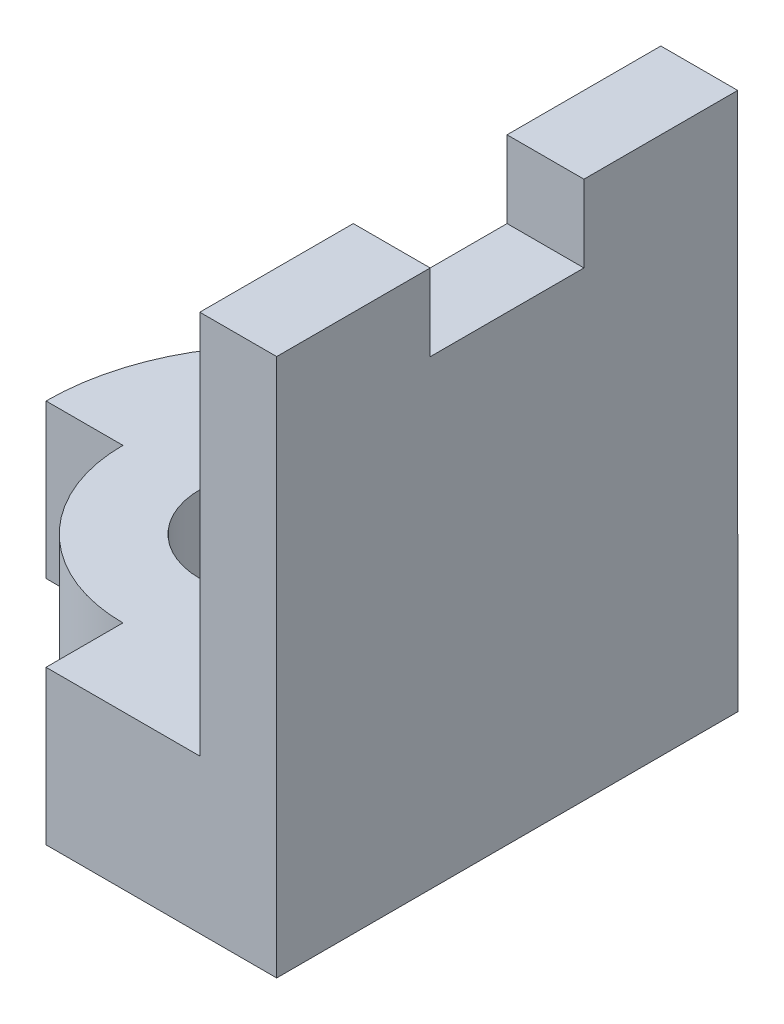
ISO-10303-21;
HEADER;
FILE_DESCRIPTION(('STEP AP214'),'2;1');
FILE_NAME('part.step','',(''),(''),'','','');
FILE_SCHEMA(('AUTOMOTIVE_DESIGN { 1 0 10303 214 1 1 1 1 }'));
ENDSEC;
DATA;
#1=APPLICATION_CONTEXT('core data for automotive mechanical design processes');
#2=APPLICATION_PROTOCOL_DEFINITION('international standard','automotive_design',2000,#1);
#3=PRODUCT_CONTEXT('',#1,'mechanical');
#4=PRODUCT('Part','Part','',(#3));
#5=PRODUCT_RELATED_PRODUCT_CATEGORY('part','',(#4));
#6=PRODUCT_DEFINITION_FORMATION('','',#4);
#7=PRODUCT_DEFINITION_CONTEXT('part definition',#1,'design');
#8=PRODUCT_DEFINITION('design','',#6,#7);
#9=PRODUCT_DEFINITION_SHAPE('','',#8);
#10=(LENGTH_UNIT() NAMED_UNIT(*) SI_UNIT(.MILLI.,.METRE.));
#11=(NAMED_UNIT(*) PLANE_ANGLE_UNIT() SI_UNIT($,.RADIAN.));
#12=(NAMED_UNIT(*) SI_UNIT($,.STERADIAN.) SOLID_ANGLE_UNIT());
#13=UNCERTAINTY_MEASURE_WITH_UNIT(LENGTH_MEASURE(1.E-05),#10,'distance_accuracy_value','');
#14=(GEOMETRIC_REPRESENTATION_CONTEXT(3) GLOBAL_UNCERTAINTY_ASSIGNED_CONTEXT((#13)) GLOBAL_UNIT_ASSIGNED_CONTEXT((#10,
#11,#12)) REPRESENTATION_CONTEXT('',''));
#15=CARTESIAN_POINT('',(0.,0.,0.));
#16=DIRECTION('',(0.,0.,1.));
#17=DIRECTION('',(1.,0.,0.));
#18=AXIS2_PLACEMENT_3D('',#15,#16,#17);
#19=CARTESIAN_POINT('',(0.,2.,0.));
#20=DIRECTION('',(0.,1.,0.));
#21=DIRECTION('',(0.,0.,1.));
#22=AXIS2_PLACEMENT_3D('',#19,#20,#21);
#23=PLANE('',#22);
#24=CARTESIAN_POINT('',(0.,2.,0.));
#25=DIRECTION('',(0.,1.,0.));
#26=DIRECTION('',(0.,0.,1.));
#27=AXIS2_PLACEMENT_3D('',#24,#25,#26);
#28=CIRCLE('',#27,1.);
#29=CARTESIAN_POINT('',(0.,2.,1.));
#30=VERTEX_POINT('',#29);
#31=EDGE_CURVE('E136',#30,#30,#28,.T.);
#32=ORIENTED_EDGE('',*,*,#31,.F.);
#33=EDGE_LOOP('',(#32));
#34=FACE_BOUND('',#33,.T.);
#35=DIRECTION('',(1.,0.,0.));
#36=VECTOR('',#35,1.);
#37=CARTESIAN_POINT('',(0.,2.,3.));
#38=LINE('',#37,#36);
#39=CARTESIAN_POINT('',(0.,2.,3.));
#40=VERTEX_POINT('',#39);
#41=CARTESIAN_POINT('',(2.,2.,3.));
#42=VERTEX_POINT('',#41);
#43=EDGE_CURVE('E146',#40,#42,#38,.T.);
#44=ORIENTED_EDGE('',*,*,#43,.T.);
#45=DIRECTION('',(0.,0.,-1.));
#46=VECTOR('',#45,1.);
#47=CARTESIAN_POINT('',(2.,2.,3.));
#48=LINE('',#47,#46);
#49=CARTESIAN_POINT('',(2.,2.,-2.99659332133392));
#50=VERTEX_POINT('',#49);
#51=EDGE_CURVE('E230',#42,#50,#48,.T.);
#52=ORIENTED_EDGE('',*,*,#51,.T.);
#53=DIRECTION('',(1.,0.,0.));
#54=VECTOR('',#53,1.);
#55=CARTESIAN_POINT('',(2.,2.,-2.99659332133392));
#56=LINE('',#55,#54);
#57=CARTESIAN_POINT('',(3.,2.,-2.99659332133392));
#58=VERTEX_POINT('',#57);
#59=EDGE_CURVE('E177',#50,#58,#56,.T.);
#60=ORIENTED_EDGE('',*,*,#59,.T.);
#61=DIRECTION('',(0.,0.,-1.));
#62=VECTOR('',#61,1.);
#63=CARTESIAN_POINT('',(3.,2.,-3.));
#64=LINE('',#63,#62);
#65=CARTESIAN_POINT('',(3.,2.,-3.));
#66=VERTEX_POINT('',#65);
#67=EDGE_CURVE('E94',#58,#66,#64,.T.);
#68=ORIENTED_EDGE('',*,*,#67,.T.);
#69=DIRECTION('',(-1.,0.,0.));
#70=VECTOR('',#69,1.);
#71=CARTESIAN_POINT('',(0.,2.,-3.));
#72=LINE('',#71,#70);
#73=CARTESIAN_POINT('',(0.,2.,-3.));
#74=VERTEX_POINT('',#73);
#75=EDGE_CURVE('E158',#66,#74,#72,.T.);
#76=ORIENTED_EDGE('',*,*,#75,.T.);
#77=CARTESIAN_POINT('',(0.,2.,0.));
#78=DIRECTION('',(0.,1.,0.));
#79=DIRECTION('',(0.,0.,1.));
#80=AXIS2_PLACEMENT_3D('',#77,#78,#79);
#81=CIRCLE('',#80,3.);
#82=CARTESIAN_POINT('',(-3.,2.,0.));
#83=VERTEX_POINT('',#82);
#84=EDGE_CURVE('E111',#74,#83,#81,.T.);
#85=ORIENTED_EDGE('',*,*,#84,.T.);
#86=DIRECTION('',(1.,0.,0.));
#87=VECTOR('',#86,1.);
#88=CARTESIAN_POINT('',(-2.,2.,0.));
#89=LINE('',#88,#87);
#90=CARTESIAN_POINT('',(-2.,2.,0.));
#91=VERTEX_POINT('',#90);
#92=EDGE_CURVE('E105',#83,#91,#89,.T.);
#93=ORIENTED_EDGE('',*,*,#92,.T.);
#94=CARTESIAN_POINT('',(0.,2.,0.));
#95=DIRECTION('',(0.,1.,0.));
#96=DIRECTION('',(0.,0.,1.));
#97=AXIS2_PLACEMENT_3D('',#94,#95,#96);
#98=CIRCLE('',#97,2.00000000000001);
#99=CARTESIAN_POINT('',(0.,2.,2.));
#100=VERTEX_POINT('',#99);
#101=EDGE_CURVE('E108',#91,#100,#98,.T.);
#102=ORIENTED_EDGE('',*,*,#101,.T.);
#103=DIRECTION('',(0.,0.,1.));
#104=VECTOR('',#103,1.);
#105=CARTESIAN_POINT('',(0.,2.,2.));
#106=LINE('',#105,#104);
#107=EDGE_CURVE('E57',#100,#40,#106,.T.);
#108=ORIENTED_EDGE('',*,*,#107,.T.);
#109=EDGE_LOOP('',(#44,#52,#60,#68,#76,#85,#93,#102,#108));
#110=FACE_BOUND('',#109,.T.);
#111=ADVANCED_FACE('F33',(#34,#110),#23,.T.);
#112=CARTESIAN_POINT('',(0.,0.,0.));
#113=DIRECTION('',(0.,1.,0.));
#114=DIRECTION('',(0.,0.,1.));
#115=AXIS2_PLACEMENT_3D('',#112,#113,#114);
#116=PLANE('',#115);
#117=DIRECTION('',(1.,0.,0.));
#118=VECTOR('',#117,1.);
#119=CARTESIAN_POINT('',(0.,0.,3.));
#120=LINE('',#119,#118);
#121=CARTESIAN_POINT('',(0.,0.,3.));
#122=VERTEX_POINT('',#121);
#123=CARTESIAN_POINT('',(3.,0.,3.));
#124=VERTEX_POINT('',#123);
#125=EDGE_CURVE('E132',#122,#124,#120,.T.);
#126=ORIENTED_EDGE('',*,*,#125,.F.);
#127=DIRECTION('',(0.,0.,1.));
#128=VECTOR('',#127,1.);
#129=CARTESIAN_POINT('',(0.,0.,2.));
#130=LINE('',#129,#128);
#131=CARTESIAN_POINT('',(0.,0.,2.));
#132=VERTEX_POINT('',#131);
#133=EDGE_CURVE('E87',#132,#122,#130,.T.);
#134=ORIENTED_EDGE('',*,*,#133,.F.);
#135=CARTESIAN_POINT('',(0.,0.,0.));
#136=DIRECTION('',(0.,1.,0.));
#137=DIRECTION('',(0.,0.,1.));
#138=AXIS2_PLACEMENT_3D('',#135,#136,#137);
#139=CIRCLE('',#138,2.00000000000001);
#140=CARTESIAN_POINT('',(-2.,0.,0.));
#141=VERTEX_POINT('',#140);
#142=EDGE_CURVE('E143',#141,#132,#139,.T.);
#143=ORIENTED_EDGE('',*,*,#142,.F.);
#144=DIRECTION('',(1.,0.,0.));
#145=VECTOR('',#144,1.);
#146=CARTESIAN_POINT('',(-2.,0.,0.));
#147=LINE('',#146,#145);
#148=CARTESIAN_POINT('',(-3.,0.,0.));
#149=VERTEX_POINT('',#148);
#150=EDGE_CURVE('E120',#149,#141,#147,.T.);
#151=ORIENTED_EDGE('',*,*,#150,.F.);
#152=CARTESIAN_POINT('',(0.,0.,0.));
#153=DIRECTION('',(0.,1.,0.));
#154=DIRECTION('',(0.,0.,1.));
#155=AXIS2_PLACEMENT_3D('',#152,#153,#154);
#156=CIRCLE('',#155,3.);
#157=CARTESIAN_POINT('',(0.,0.,-3.));
#158=VERTEX_POINT('',#157);
#159=EDGE_CURVE('E140',#158,#149,#156,.T.);
#160=ORIENTED_EDGE('',*,*,#159,.F.);
#161=DIRECTION('',(-1.,0.,0.));
#162=VECTOR('',#161,1.);
#163=CARTESIAN_POINT('',(0.,0.,-3.));
#164=LINE('',#163,#162);
#165=CARTESIAN_POINT('',(3.,0.,-3.));
#166=VERTEX_POINT('',#165);
#167=EDGE_CURVE('E138',#166,#158,#164,.T.);
#168=ORIENTED_EDGE('',*,*,#167,.F.);
#169=DIRECTION('',(0.,0.,-1.));
#170=VECTOR('',#169,1.);
#171=CARTESIAN_POINT('',(3.,0.,-3.));
#172=LINE('',#171,#170);
#173=EDGE_CURVE('E135',#124,#166,#172,.T.);
#174=ORIENTED_EDGE('',*,*,#173,.F.);
#175=EDGE_LOOP('',(#126,#134,#143,#151,#160,#168,#174));
#176=FACE_BOUND('',#175,.T.);
#177=CARTESIAN_POINT('',(0.,0.,0.));
#178=DIRECTION('',(0.,1.,0.));
#179=DIRECTION('',(0.,0.,1.));
#180=AXIS2_PLACEMENT_3D('',#177,#178,#179);
#181=CIRCLE('',#180,1.);
#182=CARTESIAN_POINT('',(0.,0.,1.));
#183=VERTEX_POINT('',#182);
#184=EDGE_CURVE('E171',#183,#183,#181,.T.);
#185=ORIENTED_EDGE('',*,*,#184,.T.);
#186=EDGE_LOOP('',(#185));
#187=FACE_BOUND('',#186,.T.);
#188=ADVANCED_FACE('F163',(#176,#187),#116,.F.);
#189=CARTESIAN_POINT('',(0.,2.,3.));
#190=DIRECTION('',(0.,0.,-1.));
#191=DIRECTION('',(-1.,0.,0.));
#192=AXIS2_PLACEMENT_3D('',#189,#190,#191);
#193=PLANE('',#192);
#194=ORIENTED_EDGE('',*,*,#125,.T.);
#195=DIRECTION('',(0.,-1.,0.));
#196=VECTOR('',#195,1.);
#197=CARTESIAN_POINT('',(3.,2.,3.));
#198=LINE('',#197,#196);
#199=CARTESIAN_POINT('',(3.,7.,3.));
#200=VERTEX_POINT('',#199);
#201=EDGE_CURVE('E11',#200,#124,#198,.T.);
#202=ORIENTED_EDGE('',*,*,#201,.F.);
#203=DIRECTION('',(1.,0.,0.));
#204=VECTOR('',#203,1.);
#205=CARTESIAN_POINT('',(2.,7.,3.));
#206=LINE('',#205,#204);
#207=CARTESIAN_POINT('',(2.,7.,3.));
#208=VERTEX_POINT('',#207);
#209=EDGE_CURVE('E174',#208,#200,#206,.T.);
#210=ORIENTED_EDGE('',*,*,#209,.F.);
#211=DIRECTION('',(0.,-1.,0.));
#212=VECTOR('',#211,1.);
#213=CARTESIAN_POINT('',(2.,2.,3.));
#214=LINE('',#213,#212);
#215=EDGE_CURVE('E199',#208,#42,#214,.T.);
#216=ORIENTED_EDGE('',*,*,#215,.T.);
#217=ORIENTED_EDGE('',*,*,#43,.F.);
#218=DIRECTION('',(0.,-1.,0.));
#219=VECTOR('',#218,1.);
#220=CARTESIAN_POINT('',(0.,2.,3.));
#221=LINE('',#220,#219);
#222=EDGE_CURVE('E128',#40,#122,#221,.T.);
#223=ORIENTED_EDGE('',*,*,#222,.T.);
#224=EDGE_LOOP('',(#194,#202,#210,#216,#217,#223));
#225=FACE_BOUND('',#224,.T.);
#226=ADVANCED_FACE('F35',(#225),#193,.F.);
#227=CARTESIAN_POINT('',(3.,2.,-3.));
#228=DIRECTION('',(-1.,0.,0.));
#229=DIRECTION('',(0.,0.,1.));
#230=AXIS2_PLACEMENT_3D('',#227,#228,#229);
#231=PLANE('',#230);
#232=ORIENTED_EDGE('',*,*,#173,.T.);
#233=DIRECTION('',(0.,-1.,0.));
#234=VECTOR('',#233,1.);
#235=CARTESIAN_POINT('',(3.,2.,-3.));
#236=LINE('',#235,#234);
#237=EDGE_CURVE('E41',#66,#166,#236,.T.);
#238=ORIENTED_EDGE('',*,*,#237,.F.);
#239=ORIENTED_EDGE('',*,*,#67,.F.);
#240=DIRECTION('',(0.,1.,0.));
#241=VECTOR('',#240,1.);
#242=CARTESIAN_POINT('',(3.,2.,-2.99659332133392));
#243=LINE('',#242,#241);
#244=CARTESIAN_POINT('',(3.,7.,-2.99659332133392));
#245=VERTEX_POINT('',#244);
#246=EDGE_CURVE('E48',#58,#245,#243,.T.);
#247=ORIENTED_EDGE('',*,*,#246,.T.);
#248=DIRECTION('',(0.,0.,1.));
#249=VECTOR('',#248,1.);
#250=CARTESIAN_POINT('',(3.,7.,-0.996593321333916));
#251=LINE('',#250,#249);
#252=CARTESIAN_POINT('',(3.,7.,-0.996593321333916));
#253=VERTEX_POINT('',#252);
#254=EDGE_CURVE('E209',#245,#253,#251,.T.);
#255=ORIENTED_EDGE('',*,*,#254,.T.);
#256=DIRECTION('',(0.,-1.,0.));
#257=VECTOR('',#256,1.);
#258=CARTESIAN_POINT('',(3.,7.,-0.996593321333916));
#259=LINE('',#258,#257);
#260=CARTESIAN_POINT('',(3.,6.,-0.996593321333916));
#261=VERTEX_POINT('',#260);
#262=EDGE_CURVE('E206',#253,#261,#259,.T.);
#263=ORIENTED_EDGE('',*,*,#262,.T.);
#264=DIRECTION('',(0.,0.,1.));
#265=VECTOR('',#264,1.);
#266=CARTESIAN_POINT('',(3.,6.,1.00340667866608));
#267=LINE('',#266,#265);
#268=CARTESIAN_POINT('',(3.,6.,1.00340667866608));
#269=VERTEX_POINT('',#268);
#270=EDGE_CURVE('E203',#261,#269,#267,.T.);
#271=ORIENTED_EDGE('',*,*,#270,.T.);
#272=DIRECTION('',(0.,1.,0.));
#273=VECTOR('',#272,1.);
#274=CARTESIAN_POINT('',(3.,7.,1.00340667866608));
#275=LINE('',#274,#273);
#276=CARTESIAN_POINT('',(3.,7.,1.00340667866608));
#277=VERTEX_POINT('',#276);
#278=EDGE_CURVE('E200',#269,#277,#275,.T.);
#279=ORIENTED_EDGE('',*,*,#278,.T.);
#280=DIRECTION('',(0.,0.,1.));
#281=VECTOR('',#280,1.);
#282=CARTESIAN_POINT('',(3.,7.,3.));
#283=LINE('',#282,#281);
#284=EDGE_CURVE('E196',#277,#200,#283,.T.);
#285=ORIENTED_EDGE('',*,*,#284,.T.);
#286=ORIENTED_EDGE('',*,*,#201,.T.);
#287=EDGE_LOOP('',(#232,#238,#239,#247,#255,#263,#271,#279,#285,#286));
#288=FACE_BOUND('',#287,.T.);
#289=ADVANCED_FACE('F283',(#288),#231,.F.);
#290=CARTESIAN_POINT('',(0.,2.,-3.));
#291=DIRECTION('',(0.,0.,1.));
#292=DIRECTION('',(1.,0.,0.));
#293=AXIS2_PLACEMENT_3D('',#290,#291,#292);
#294=PLANE('',#293);
#295=ORIENTED_EDGE('',*,*,#167,.T.);
#296=DIRECTION('',(0.,-1.,0.));
#297=VECTOR('',#296,1.);
#298=CARTESIAN_POINT('',(0.,2.,-3.));
#299=LINE('',#298,#297);
#300=EDGE_CURVE('E150',#74,#158,#299,.T.);
#301=ORIENTED_EDGE('',*,*,#300,.F.);
#302=ORIENTED_EDGE('',*,*,#75,.F.);
#303=ORIENTED_EDGE('',*,*,#237,.T.);
#304=EDGE_LOOP('',(#295,#301,#302,#303));
#305=FACE_BOUND('',#304,.T.);
#306=ADVANCED_FACE('F156',(#305),#294,.F.);
#307=CARTESIAN_POINT('',(0.,2.,0.));
#308=DIRECTION('',(0.,-1.,0.));
#309=DIRECTION('',(0.,0.,-1.));
#310=AXIS2_PLACEMENT_3D('',#307,#308,#309);
#311=CYLINDRICAL_SURFACE('',#310,3.);
#312=ORIENTED_EDGE('',*,*,#159,.T.);
#313=DIRECTION('',(0.,-1.,0.));
#314=VECTOR('',#313,1.);
#315=CARTESIAN_POINT('',(-3.,2.,0.));
#316=LINE('',#315,#314);
#317=EDGE_CURVE('E123',#83,#149,#316,.T.);
#318=ORIENTED_EDGE('',*,*,#317,.F.);
#319=ORIENTED_EDGE('',*,*,#84,.F.);
#320=ORIENTED_EDGE('',*,*,#300,.T.);
#321=EDGE_LOOP('',(#312,#318,#319,#320));
#322=FACE_BOUND('',#321,.T.);
#323=ADVANCED_FACE('F166',(#322),#311,.T.);
#324=CARTESIAN_POINT('',(-2.,2.,0.));
#325=DIRECTION('',(0.,0.,-1.));
#326=DIRECTION('',(-1.,0.,0.));
#327=AXIS2_PLACEMENT_3D('',#324,#325,#326);
#328=PLANE('',#327);
#329=ORIENTED_EDGE('',*,*,#150,.T.);
#330=DIRECTION('',(0.,-1.,0.));
#331=VECTOR('',#330,1.);
#332=CARTESIAN_POINT('',(-2.,2.,0.));
#333=LINE('',#332,#331);
#334=EDGE_CURVE('E117',#91,#141,#333,.T.);
#335=ORIENTED_EDGE('',*,*,#334,.F.);
#336=ORIENTED_EDGE('',*,*,#92,.F.);
#337=ORIENTED_EDGE('',*,*,#317,.T.);
#338=EDGE_LOOP('',(#329,#335,#336,#337));
#339=FACE_BOUND('',#338,.T.);
#340=ADVANCED_FACE('F118',(#339),#328,.F.);
#341=CARTESIAN_POINT('',(0.,2.,0.));
#342=DIRECTION('',(0.,-1.,0.));
#343=DIRECTION('',(0.,0.,-1.));
#344=AXIS2_PLACEMENT_3D('',#341,#342,#343);
#345=CYLINDRICAL_SURFACE('',#344,2.00000000000001);
#346=ORIENTED_EDGE('',*,*,#142,.T.);
#347=DIRECTION('',(0.,-1.,0.));
#348=VECTOR('',#347,1.);
#349=CARTESIAN_POINT('',(0.,2.,2.));
#350=LINE('',#349,#348);
#351=EDGE_CURVE('E124',#100,#132,#350,.T.);
#352=ORIENTED_EDGE('',*,*,#351,.F.);
#353=ORIENTED_EDGE('',*,*,#101,.F.);
#354=ORIENTED_EDGE('',*,*,#334,.T.);
#355=EDGE_LOOP('',(#346,#352,#353,#354));
#356=FACE_BOUND('',#355,.T.);
#357=ADVANCED_FACE('F126',(#356),#345,.T.);
#358=CARTESIAN_POINT('',(0.,2.,2.));
#359=DIRECTION('',(1.,0.,0.));
#360=DIRECTION('',(0.,0.,-1.));
#361=AXIS2_PLACEMENT_3D('',#358,#359,#360);
#362=PLANE('',#361);
#363=ORIENTED_EDGE('',*,*,#133,.T.);
#364=ORIENTED_EDGE('',*,*,#222,.F.);
#365=ORIENTED_EDGE('',*,*,#107,.F.);
#366=ORIENTED_EDGE('',*,*,#351,.T.);
#367=EDGE_LOOP('',(#363,#364,#365,#366));
#368=FACE_BOUND('',#367,.T.);
#369=ADVANCED_FACE('F313',(#368),#362,.F.);
#370=CARTESIAN_POINT('',(0.,2.,0.));
#371=DIRECTION('',(0.,-1.,0.));
#372=DIRECTION('',(0.,0.,-1.));
#373=AXIS2_PLACEMENT_3D('',#370,#371,#372);
#374=CYLINDRICAL_SURFACE('',#373,1.);
#375=ORIENTED_EDGE('',*,*,#31,.T.);
#376=EDGE_LOOP('',(#375));
#377=FACE_BOUND('',#376,.T.);
#378=ORIENTED_EDGE('',*,*,#184,.F.);
#379=EDGE_LOOP('',(#378));
#380=FACE_BOUND('',#379,.T.);
#381=ADVANCED_FACE('F311',(#377,#380),#374,.F.);
#382=CARTESIAN_POINT('',(2.,7.,3.));
#383=DIRECTION('',(0.,1.,0.));
#384=DIRECTION('',(0.,0.,1.));
#385=AXIS2_PLACEMENT_3D('',#382,#383,#384);
#386=PLANE('',#385);
#387=ORIENTED_EDGE('',*,*,#284,.F.);
#388=DIRECTION('',(1.,0.,0.));
#389=VECTOR('',#388,1.);
#390=CARTESIAN_POINT('',(2.,7.,1.00340667866608));
#391=LINE('',#390,#389);
#392=CARTESIAN_POINT('',(2.,7.,1.00340667866608));
#393=VERTEX_POINT('',#392);
#394=EDGE_CURVE('E191',#393,#277,#391,.T.);
#395=ORIENTED_EDGE('',*,*,#394,.F.);
#396=DIRECTION('',(0.,0.,1.));
#397=VECTOR('',#396,1.);
#398=CARTESIAN_POINT('',(2.,7.,3.));
#399=LINE('',#398,#397);
#400=EDGE_CURVE('E180',#393,#208,#399,.T.);
#401=ORIENTED_EDGE('',*,*,#400,.T.);
#402=ORIENTED_EDGE('',*,*,#209,.T.);
#403=EDGE_LOOP('',(#387,#395,#401,#402));
#404=FACE_BOUND('',#403,.T.);
#405=ADVANCED_FACE('F282',(#404),#386,.T.);
#406=CARTESIAN_POINT('',(2.,7.,1.00340667866608));
#407=DIRECTION('',(0.,0.,-1.));
#408=DIRECTION('',(0.,1.,0.));
#409=AXIS2_PLACEMENT_3D('',#406,#407,#408);
#410=PLANE('',#409);
#411=ORIENTED_EDGE('',*,*,#278,.F.);
#412=DIRECTION('',(1.,0.,0.));
#413=VECTOR('',#412,1.);
#414=CARTESIAN_POINT('',(2.,6.,1.00340667866608));
#415=LINE('',#414,#413);
#416=CARTESIAN_POINT('',(2.,6.,1.00340667866608));
#417=VERTEX_POINT('',#416);
#418=EDGE_CURVE('E188',#417,#269,#415,.T.);
#419=ORIENTED_EDGE('',*,*,#418,.F.);
#420=DIRECTION('',(0.,1.,0.));
#421=VECTOR('',#420,1.);
#422=CARTESIAN_POINT('',(2.,7.,1.00340667866608));
#423=LINE('',#422,#421);
#424=EDGE_CURVE('E215',#417,#393,#423,.T.);
#425=ORIENTED_EDGE('',*,*,#424,.T.);
#426=ORIENTED_EDGE('',*,*,#394,.T.);
#427=EDGE_LOOP('',(#411,#419,#425,#426));
#428=FACE_BOUND('',#427,.T.);
#429=ADVANCED_FACE('F285',(#428),#410,.T.);
#430=CARTESIAN_POINT('',(2.,6.,1.00340667866608));
#431=DIRECTION('',(0.,1.,0.));
#432=DIRECTION('',(0.,0.,1.));
#433=AXIS2_PLACEMENT_3D('',#430,#431,#432);
#434=PLANE('',#433);
#435=ORIENTED_EDGE('',*,*,#270,.F.);
#436=DIRECTION('',(1.,0.,0.));
#437=VECTOR('',#436,1.);
#438=CARTESIAN_POINT('',(2.,6.,-0.996593321333916));
#439=LINE('',#438,#437);
#440=CARTESIAN_POINT('',(2.,6.,-0.996593321333916));
#441=VERTEX_POINT('',#440);
#442=EDGE_CURVE('E185',#441,#261,#439,.T.);
#443=ORIENTED_EDGE('',*,*,#442,.F.);
#444=DIRECTION('',(0.,0.,1.));
#445=VECTOR('',#444,1.);
#446=CARTESIAN_POINT('',(2.,6.,1.00340667866608));
#447=LINE('',#446,#445);
#448=EDGE_CURVE('E218',#441,#417,#447,.T.);
#449=ORIENTED_EDGE('',*,*,#448,.T.);
#450=ORIENTED_EDGE('',*,*,#418,.T.);
#451=EDGE_LOOP('',(#435,#443,#449,#450));
#452=FACE_BOUND('',#451,.T.);
#453=ADVANCED_FACE('F289',(#452),#434,.T.);
#454=CARTESIAN_POINT('',(2.,7.,-0.996593321333916));
#455=DIRECTION('',(0.,0.,1.));
#456=DIRECTION('',(0.,-1.,0.));
#457=AXIS2_PLACEMENT_3D('',#454,#455,#456);
#458=PLANE('',#457);
#459=ORIENTED_EDGE('',*,*,#262,.F.);
#460=DIRECTION('',(1.,0.,0.));
#461=VECTOR('',#460,1.);
#462=CARTESIAN_POINT('',(2.,7.,-0.996593321333916));
#463=LINE('',#462,#461);
#464=CARTESIAN_POINT('',(2.,7.,-0.996593321333916));
#465=VERTEX_POINT('',#464);
#466=EDGE_CURVE('E182',#465,#253,#463,.T.);
#467=ORIENTED_EDGE('',*,*,#466,.F.);
#468=DIRECTION('',(0.,-1.,0.));
#469=VECTOR('',#468,1.);
#470=CARTESIAN_POINT('',(2.,7.,-0.996593321333916));
#471=LINE('',#470,#469);
#472=EDGE_CURVE('E221',#465,#441,#471,.T.);
#473=ORIENTED_EDGE('',*,*,#472,.T.);
#474=ORIENTED_EDGE('',*,*,#442,.T.);
#475=EDGE_LOOP('',(#459,#467,#473,#474));
#476=FACE_BOUND('',#475,.T.);
#477=ADVANCED_FACE('F292',(#476),#458,.T.);
#478=CARTESIAN_POINT('',(2.,7.,-0.996593321333916));
#479=DIRECTION('',(0.,1.,0.));
#480=DIRECTION('',(0.,0.,1.));
#481=AXIS2_PLACEMENT_3D('',#478,#479,#480);
#482=PLANE('',#481);
#483=ORIENTED_EDGE('',*,*,#254,.F.);
#484=DIRECTION('',(1.,0.,0.));
#485=VECTOR('',#484,1.);
#486=CARTESIAN_POINT('',(2.,7.,-2.99659332133392));
#487=LINE('',#486,#485);
#488=CARTESIAN_POINT('',(2.,7.,-2.99659332133392));
#489=VERTEX_POINT('',#488);
#490=EDGE_CURVE('E179',#489,#245,#487,.T.);
#491=ORIENTED_EDGE('',*,*,#490,.F.);
#492=DIRECTION('',(0.,0.,1.));
#493=VECTOR('',#492,1.);
#494=CARTESIAN_POINT('',(2.,7.,-0.996593321333916));
#495=LINE('',#494,#493);
#496=EDGE_CURVE('E224',#489,#465,#495,.T.);
#497=ORIENTED_EDGE('',*,*,#496,.T.);
#498=ORIENTED_EDGE('',*,*,#466,.T.);
#499=EDGE_LOOP('',(#483,#491,#497,#498));
#500=FACE_BOUND('',#499,.T.);
#501=ADVANCED_FACE('F293',(#500),#482,.T.);
#502=CARTESIAN_POINT('',(2.,2.,-2.99659332133392));
#503=DIRECTION('',(0.,0.,-1.));
#504=DIRECTION('',(-1.,0.,0.));
#505=AXIS2_PLACEMENT_3D('',#502,#503,#504);
#506=PLANE('',#505);
#507=ORIENTED_EDGE('',*,*,#246,.F.);
#508=ORIENTED_EDGE('',*,*,#59,.F.);
#509=DIRECTION('',(0.,1.,0.));
#510=VECTOR('',#509,1.);
#511=CARTESIAN_POINT('',(2.,2.,-2.99659332133392));
#512=LINE('',#511,#510);
#513=EDGE_CURVE('E227',#50,#489,#512,.T.);
#514=ORIENTED_EDGE('',*,*,#513,.T.);
#515=ORIENTED_EDGE('',*,*,#490,.T.);
#516=EDGE_LOOP('',(#507,#508,#514,#515));
#517=FACE_BOUND('',#516,.T.);
#518=ADVANCED_FACE('F251',(#517),#506,.T.);
#519=CARTESIAN_POINT('',(2.,0.,0.));
#520=DIRECTION('',(-1.,0.,0.));
#521=DIRECTION('',(0.,0.,1.));
#522=AXIS2_PLACEMENT_3D('',#519,#520,#521);
#523=PLANE('',#522);
#524=ORIENTED_EDGE('',*,*,#215,.F.);
#525=ORIENTED_EDGE('',*,*,#400,.F.);
#526=ORIENTED_EDGE('',*,*,#424,.F.);
#527=ORIENTED_EDGE('',*,*,#448,.F.);
#528=ORIENTED_EDGE('',*,*,#472,.F.);
#529=ORIENTED_EDGE('',*,*,#496,.F.);
#530=ORIENTED_EDGE('',*,*,#513,.F.);
#531=ORIENTED_EDGE('',*,*,#51,.F.);
#532=EDGE_LOOP('',(#524,#525,#526,#527,#528,#529,#530,#531));
#533=FACE_BOUND('',#532,.T.);
#534=ADVANCED_FACE('F248',(#533),#523,.T.);
#535=CLOSED_SHELL('',(#111,#188,#226,#289,#306,#323,#340,#357,#369,#381,#405,#429,#453,#477,
#501,#518,#534));
#536=MANIFOLD_SOLID_BREP('B2',#535);
#537=ADVANCED_BREP_SHAPE_REPRESENTATION('',(#18,#536),#14);
#538=SHAPE_DEFINITION_REPRESENTATION(#9,#537);
ENDSEC;
END-ISO-10303-21;
